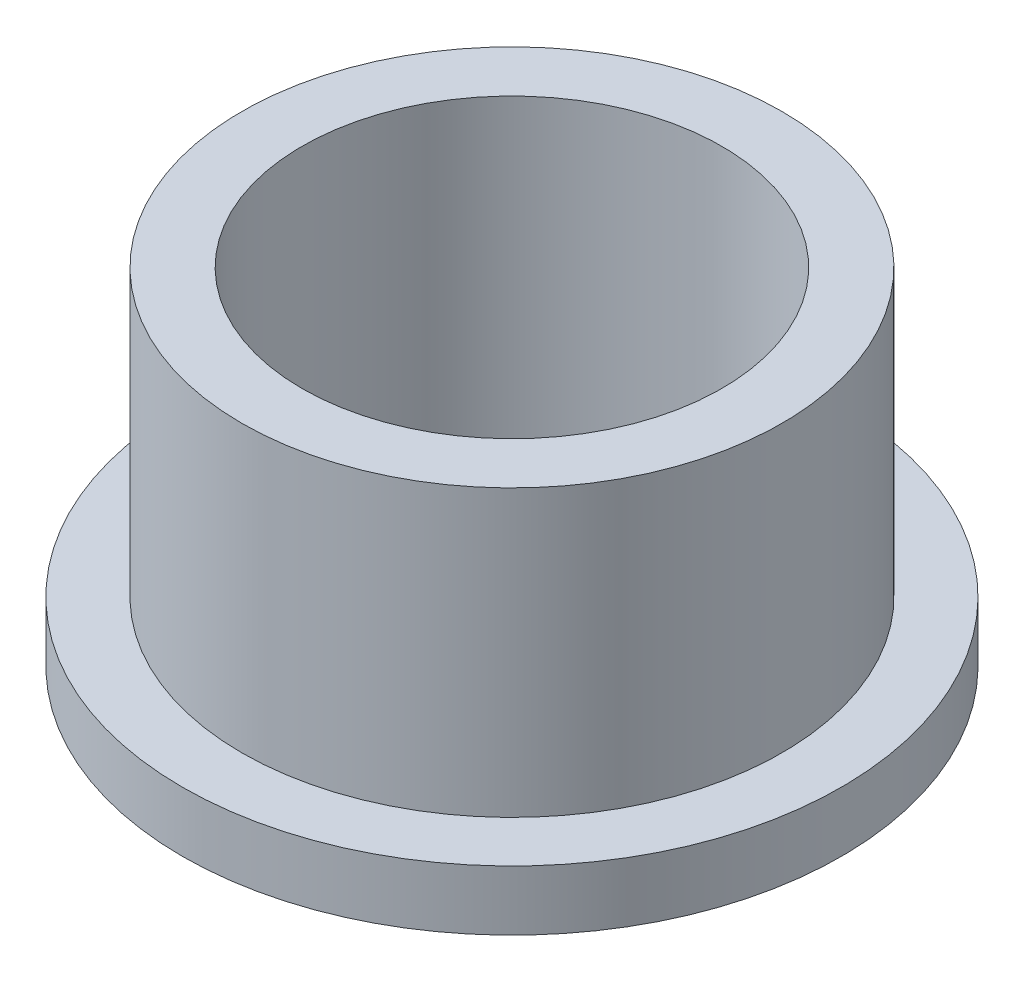
ISO-10303-21;
HEADER;
FILE_DESCRIPTION(('STEP AP214'),'2;1');
FILE_NAME('part.step','',(''),(''),'','','');
FILE_SCHEMA(('AUTOMOTIVE_DESIGN { 1 0 10303 214 1 1 1 1 }'));
ENDSEC;
DATA;
#1=APPLICATION_CONTEXT('core data for automotive mechanical design processes');
#2=APPLICATION_PROTOCOL_DEFINITION('international standard','automotive_design',2000,#1);
#3=PRODUCT_CONTEXT('',#1,'mechanical');
#4=PRODUCT('Part','Part','',(#3));
#5=PRODUCT_RELATED_PRODUCT_CATEGORY('part','',(#4));
#6=PRODUCT_DEFINITION_FORMATION('','',#4);
#7=PRODUCT_DEFINITION_CONTEXT('part definition',#1,'design');
#8=PRODUCT_DEFINITION('design','',#6,#7);
#9=PRODUCT_DEFINITION_SHAPE('','',#8);
#10=(LENGTH_UNIT() NAMED_UNIT(*) SI_UNIT(.MILLI.,.METRE.));
#11=(NAMED_UNIT(*) PLANE_ANGLE_UNIT() SI_UNIT($,.RADIAN.));
#12=(NAMED_UNIT(*) SI_UNIT($,.STERADIAN.) SOLID_ANGLE_UNIT());
#13=UNCERTAINTY_MEASURE_WITH_UNIT(LENGTH_MEASURE(1.E-05),#10,'distance_accuracy_value','');
#14=(GEOMETRIC_REPRESENTATION_CONTEXT(3) GLOBAL_UNCERTAINTY_ASSIGNED_CONTEXT((#13)) GLOBAL_UNIT_ASSIGNED_CONTEXT((#10,
#11,#12)) REPRESENTATION_CONTEXT('',''));
#15=CARTESIAN_POINT('',(0.,0.,0.));
#16=DIRECTION('',(0.,0.,1.));
#17=DIRECTION('',(1.,0.,0.));
#18=AXIS2_PLACEMENT_3D('',#15,#16,#17);
#19=CARTESIAN_POINT('',(0.,14.,0.));
#20=DIRECTION('',(0.,-1.,0.));
#21=DIRECTION('',(0.,0.,-1.));
#22=AXIS2_PLACEMENT_3D('',#19,#20,#21);
#23=CYLINDRICAL_SURFACE('',#22,9.015);
#24=CARTESIAN_POINT('',(0.,2.,0.));
#25=DIRECTION('',(0.,1.,0.));
#26=DIRECTION('',(0.,0.,1.));
#27=AXIS2_PLACEMENT_3D('',#24,#25,#26);
#28=CIRCLE('',#27,9.015);
#29=CARTESIAN_POINT('',(0.,2.,9.015));
#30=VERTEX_POINT('',#29);
#31=EDGE_CURVE('E46',#30,#30,#28,.T.);
#32=ORIENTED_EDGE('',*,*,#31,.T.);
#33=EDGE_LOOP('',(#32));
#34=FACE_BOUND('',#33,.T.);
#35=CARTESIAN_POINT('',(0.,11.525,0.));
#36=DIRECTION('',(0.,1.,0.));
#37=DIRECTION('',(0.,0.,1.));
#38=AXIS2_PLACEMENT_3D('',#35,#36,#37);
#39=CIRCLE('',#38,9.015);
#40=CARTESIAN_POINT('',(0.,11.525,9.015));
#41=VERTEX_POINT('',#40);
#42=EDGE_CURVE('E50',#41,#41,#39,.T.);
#43=ORIENTED_EDGE('',*,*,#42,.F.);
#44=EDGE_LOOP('',(#43));
#45=FACE_BOUND('',#44,.T.);
#46=ADVANCED_FACE('F31',(#34,#45),#23,.T.);
#47=CARTESIAN_POINT('',(0.,14.,0.));
#48=DIRECTION('',(0.,-1.,0.));
#49=DIRECTION('',(0.,0.,-1.));
#50=AXIS2_PLACEMENT_3D('',#47,#48,#49);
#51=CYLINDRICAL_SURFACE('',#50,7.005);
#52=CARTESIAN_POINT('',(0.,0.,0.));
#53=DIRECTION('',(0.,1.,0.));
#54=DIRECTION('',(0.,0.,1.));
#55=AXIS2_PLACEMENT_3D('',#52,#53,#54);
#56=CIRCLE('',#55,7.005);
#57=CARTESIAN_POINT('',(0.,0.,7.005));
#58=VERTEX_POINT('',#57);
#59=EDGE_CURVE('E10',#58,#58,#56,.T.);
#60=ORIENTED_EDGE('',*,*,#59,.F.);
#61=EDGE_LOOP('',(#60));
#62=FACE_BOUND('',#61,.T.);
#63=CARTESIAN_POINT('',(0.,11.525,0.));
#64=DIRECTION('',(0.,1.,0.));
#65=DIRECTION('',(0.,0.,1.));
#66=AXIS2_PLACEMENT_3D('',#63,#64,#65);
#67=CIRCLE('',#66,7.005);
#68=CARTESIAN_POINT('',(0.,11.525,7.005));
#69=VERTEX_POINT('',#68);
#70=EDGE_CURVE('E34',#69,#69,#67,.T.);
#71=ORIENTED_EDGE('',*,*,#70,.T.);
#72=EDGE_LOOP('',(#71));
#73=FACE_BOUND('',#72,.T.);
#74=ADVANCED_FACE('F57',(#62,#73),#51,.F.);
#75=CARTESIAN_POINT('',(0.,0.,0.));
#76=DIRECTION('',(0.,1.,0.));
#77=DIRECTION('',(0.,0.,1.));
#78=AXIS2_PLACEMENT_3D('',#75,#76,#77);
#79=PLANE('',#78);
#80=ORIENTED_EDGE('',*,*,#59,.T.);
#81=EDGE_LOOP('',(#80));
#82=FACE_BOUND('',#81,.T.);
#83=CARTESIAN_POINT('',(0.,0.,0.));
#84=DIRECTION('',(0.,1.,0.));
#85=DIRECTION('',(0.,0.,1.));
#86=AXIS2_PLACEMENT_3D('',#83,#84,#85);
#87=CIRCLE('',#86,11.);
#88=CARTESIAN_POINT('',(0.,0.,11.));
#89=VERTEX_POINT('',#88);
#90=EDGE_CURVE('E42',#89,#89,#87,.T.);
#91=ORIENTED_EDGE('',*,*,#90,.F.);
#92=EDGE_LOOP('',(#91));
#93=FACE_BOUND('',#92,.T.);
#94=ADVANCED_FACE('F77',(#82,#93),#79,.F.);
#95=CARTESIAN_POINT('',(0.,2.,0.));
#96=DIRECTION('',(0.,1.,0.));
#97=DIRECTION('',(0.,0.,1.));
#98=AXIS2_PLACEMENT_3D('',#95,#96,#97);
#99=PLANE('',#98);
#100=CARTESIAN_POINT('',(0.,2.,0.));
#101=DIRECTION('',(0.,1.,0.));
#102=DIRECTION('',(0.,0.,1.));
#103=AXIS2_PLACEMENT_3D('',#100,#101,#102);
#104=CIRCLE('',#103,11.);
#105=CARTESIAN_POINT('',(0.,2.,11.));
#106=VERTEX_POINT('',#105);
#107=EDGE_CURVE('E38',#106,#106,#104,.T.);
#108=ORIENTED_EDGE('',*,*,#107,.T.);
#109=EDGE_LOOP('',(#108));
#110=FACE_BOUND('',#109,.T.);
#111=ORIENTED_EDGE('',*,*,#31,.F.);
#112=EDGE_LOOP('',(#111));
#113=FACE_BOUND('',#112,.T.);
#114=ADVANCED_FACE('F67',(#110,#113),#99,.T.);
#115=CARTESIAN_POINT('',(0.,2.,0.));
#116=DIRECTION('',(0.,-1.,0.));
#117=DIRECTION('',(0.,0.,-1.));
#118=AXIS2_PLACEMENT_3D('',#115,#116,#117);
#119=CYLINDRICAL_SURFACE('',#118,11.);
#120=ORIENTED_EDGE('',*,*,#107,.F.);
#121=EDGE_LOOP('',(#120));
#122=FACE_BOUND('',#121,.T.);
#123=ORIENTED_EDGE('',*,*,#90,.T.);
#124=EDGE_LOOP('',(#123));
#125=FACE_BOUND('',#124,.T.);
#126=ADVANCED_FACE('F61',(#122,#125),#119,.T.);
#127=CARTESIAN_POINT('',(0.,11.525,0.));
#128=DIRECTION('',(0.,1.,0.));
#129=DIRECTION('',(0.,0.,1.));
#130=AXIS2_PLACEMENT_3D('',#127,#128,#129);
#131=PLANE('',#130);
#132=ORIENTED_EDGE('',*,*,#70,.F.);
#133=EDGE_LOOP('',(#132));
#134=FACE_BOUND('',#133,.T.);
#135=ORIENTED_EDGE('',*,*,#42,.T.);
#136=EDGE_LOOP('',(#135));
#137=FACE_BOUND('',#136,.T.);
#138=ADVANCED_FACE('F59',(#134,#137),#131,.T.);
#139=CLOSED_SHELL('',(#46,#74,#94,#114,#126,#138));
#140=MANIFOLD_SOLID_BREP('B2',#139);
#141=ADVANCED_BREP_SHAPE_REPRESENTATION('',(#18,#140),#14);
#142=SHAPE_DEFINITION_REPRESENTATION(#9,#141);
ENDSEC;
END-ISO-10303-21;
